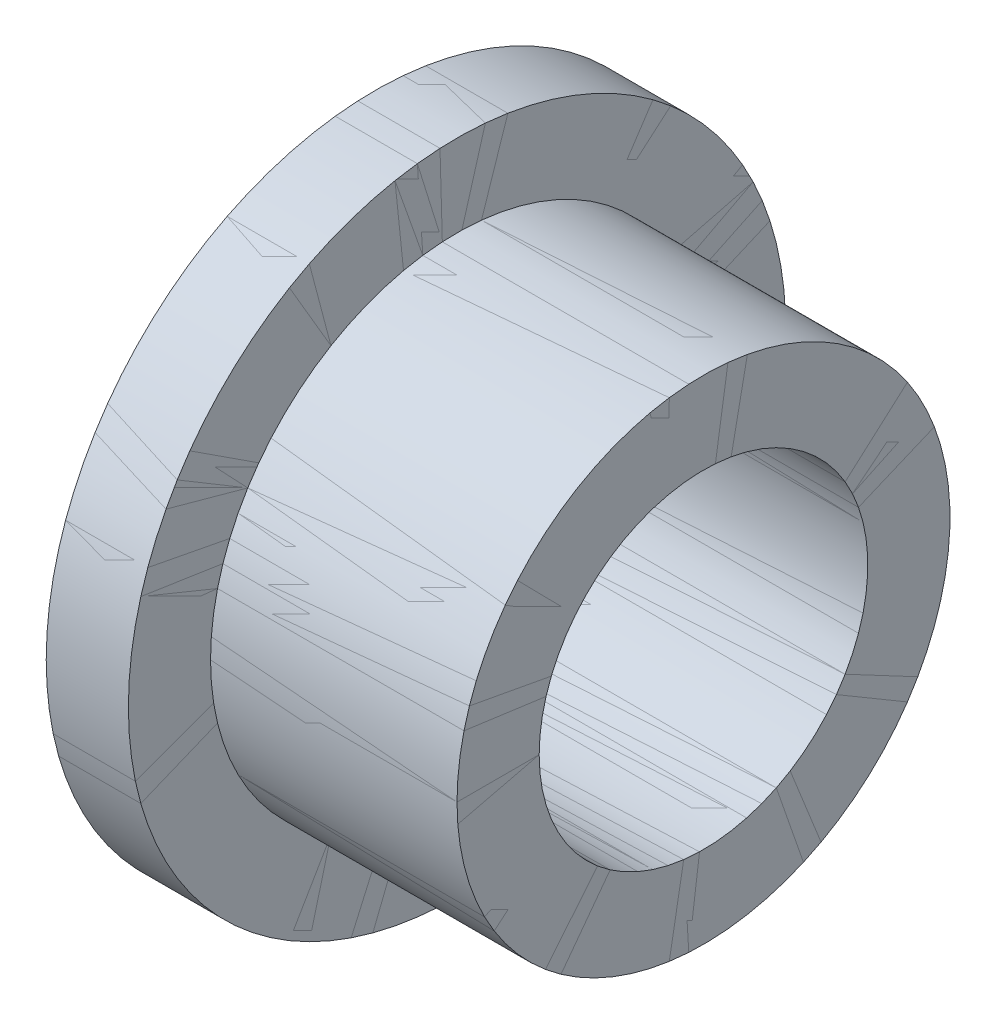
ISO-10303-21;
HEADER;
FILE_DESCRIPTION(('STEP AP214'),'2;1');
FILE_NAME('part.step','',(''),(''),'','','');
FILE_SCHEMA(('AUTOMOTIVE_DESIGN { 1 0 10303 214 1 1 1 1 }'));
ENDSEC;
DATA;
#1=APPLICATION_CONTEXT('core data for automotive mechanical design processes');
#2=APPLICATION_PROTOCOL_DEFINITION('international standard','automotive_design',2000,#1);
#3=PRODUCT_CONTEXT('',#1,'mechanical');
#4=PRODUCT('Part','Part','',(#3));
#5=PRODUCT_RELATED_PRODUCT_CATEGORY('part','',(#4));
#6=PRODUCT_DEFINITION_FORMATION('','',#4);
#7=PRODUCT_DEFINITION_CONTEXT('part definition',#1,'design');
#8=PRODUCT_DEFINITION('design','',#6,#7);
#9=PRODUCT_DEFINITION_SHAPE('','',#8);
#10=(LENGTH_UNIT() NAMED_UNIT(*) SI_UNIT(.MILLI.,.METRE.));
#11=(NAMED_UNIT(*) PLANE_ANGLE_UNIT() SI_UNIT($,.RADIAN.));
#12=(NAMED_UNIT(*) SI_UNIT($,.STERADIAN.) SOLID_ANGLE_UNIT());
#13=UNCERTAINTY_MEASURE_WITH_UNIT(LENGTH_MEASURE(1.E-05),#10,'distance_accuracy_value','');
#14=(GEOMETRIC_REPRESENTATION_CONTEXT(3) GLOBAL_UNCERTAINTY_ASSIGNED_CONTEXT((#13)) GLOBAL_UNIT_ASSIGNED_CONTEXT((#10,
#11,#12)) REPRESENTATION_CONTEXT('',''));
#15=CARTESIAN_POINT('',(0.,0.,0.));
#16=DIRECTION('',(0.,0.,1.));
#17=DIRECTION('',(1.,0.,0.));
#18=AXIS2_PLACEMENT_3D('',#15,#16,#17);
#19=CARTESIAN_POINT('',(0.,0.,0.));
#20=DIRECTION('',(-1.,0.,0.));
#21=DIRECTION('',(0.,0.,1.));
#22=AXIS2_PLACEMENT_3D('',#19,#20,#21);
#23=CYLINDRICAL_SURFACE('',#22,3.175);
#24=CARTESIAN_POINT('',(0.,0.,0.));
#25=DIRECTION('',(-1.,0.,0.));
#26=DIRECTION('',(0.,0.,1.));
#27=AXIS2_PLACEMENT_3D('',#24,#25,#26);
#28=CIRCLE('',#27,3.175);
#29=CARTESIAN_POINT('',(0.,0.,3.175));
#30=VERTEX_POINT('',#29);
#31=EDGE_CURVE('E60',#30,#30,#28,.T.);
#32=ORIENTED_EDGE('',*,*,#31,.T.);
#33=EDGE_LOOP('',(#32));
#34=FACE_BOUND('',#33,.T.);
#35=CARTESIAN_POINT('',(6.35,0.,0.));
#36=DIRECTION('',(-1.,0.,0.));
#37=DIRECTION('',(0.,0.,1.));
#38=AXIS2_PLACEMENT_3D('',#35,#36,#37);
#39=CIRCLE('',#38,3.175);
#40=CARTESIAN_POINT('',(6.35,0.,3.175));
#41=VERTEX_POINT('',#40);
#42=EDGE_CURVE('E11',#41,#41,#39,.T.);
#43=ORIENTED_EDGE('',*,*,#42,.F.);
#44=EDGE_LOOP('',(#43));
#45=FACE_BOUND('',#44,.T.);
#46=ADVANCED_FACE('F38',(#34,#45),#23,.F.);
#47=CARTESIAN_POINT('',(6.35,0.,3.175));
#48=DIRECTION('',(1.,0.,0.));
#49=DIRECTION('',(0.,0.,-1.));
#50=AXIS2_PLACEMENT_3D('',#47,#48,#49);
#51=PLANE('',#50);
#52=ORIENTED_EDGE('',*,*,#42,.T.);
#53=EDGE_LOOP('',(#52));
#54=FACE_BOUND('',#53,.T.);
#55=CARTESIAN_POINT('',(6.35,0.,0.));
#56=DIRECTION('',(-1.,0.,0.));
#57=DIRECTION('',(0.,0.,1.));
#58=AXIS2_PLACEMENT_3D('',#55,#56,#57);
#59=CIRCLE('',#58,4.7625);
#60=CARTESIAN_POINT('',(6.35,0.,4.7625));
#61=VERTEX_POINT('',#60);
#62=EDGE_CURVE('E44',#61,#61,#59,.T.);
#63=ORIENTED_EDGE('',*,*,#62,.F.);
#64=EDGE_LOOP('',(#63));
#65=FACE_BOUND('',#64,.T.);
#66=ADVANCED_FACE('F78',(#54,#65),#51,.T.);
#67=CARTESIAN_POINT('',(0.,0.,0.));
#68=DIRECTION('',(-1.,0.,0.));
#69=DIRECTION('',(0.,0.,1.));
#70=AXIS2_PLACEMENT_3D('',#67,#68,#69);
#71=CYLINDRICAL_SURFACE('',#70,4.7625);
#72=ORIENTED_EDGE('',*,*,#62,.T.);
#73=EDGE_LOOP('',(#72));
#74=FACE_BOUND('',#73,.T.);
#75=CARTESIAN_POINT('',(1.5875,0.,0.));
#76=DIRECTION('',(-1.,0.,0.));
#77=DIRECTION('',(0.,0.,1.));
#78=AXIS2_PLACEMENT_3D('',#75,#76,#77);
#79=CIRCLE('',#78,4.7625);
#80=CARTESIAN_POINT('',(1.5875,0.,4.7625));
#81=VERTEX_POINT('',#80);
#82=EDGE_CURVE('E48',#81,#81,#79,.T.);
#83=ORIENTED_EDGE('',*,*,#82,.F.);
#84=EDGE_LOOP('',(#83));
#85=FACE_BOUND('',#84,.T.);
#86=ADVANCED_FACE('F82',(#74,#85),#71,.T.);
#87=CARTESIAN_POINT('',(1.5875,0.,4.7625));
#88=DIRECTION('',(1.,0.,0.));
#89=DIRECTION('',(0.,0.,-1.));
#90=AXIS2_PLACEMENT_3D('',#87,#88,#89);
#91=PLANE('',#90);
#92=ORIENTED_EDGE('',*,*,#82,.T.);
#93=EDGE_LOOP('',(#92));
#94=FACE_BOUND('',#93,.T.);
#95=CARTESIAN_POINT('',(1.5875,0.,0.));
#96=DIRECTION('',(-1.,0.,0.));
#97=DIRECTION('',(0.,0.,1.));
#98=AXIS2_PLACEMENT_3D('',#95,#96,#97);
#99=CIRCLE('',#98,6.35);
#100=CARTESIAN_POINT('',(1.5875,0.,6.35));
#101=VERTEX_POINT('',#100);
#102=EDGE_CURVE('E52',#101,#101,#99,.T.);
#103=ORIENTED_EDGE('',*,*,#102,.F.);
#104=EDGE_LOOP('',(#103));
#105=FACE_BOUND('',#104,.T.);
#106=ADVANCED_FACE('F74',(#94,#105),#91,.T.);
#107=CARTESIAN_POINT('',(0.,0.,0.));
#108=DIRECTION('',(-1.,0.,0.));
#109=DIRECTION('',(0.,0.,1.));
#110=AXIS2_PLACEMENT_3D('',#107,#108,#109);
#111=CYLINDRICAL_SURFACE('',#110,6.35);
#112=ORIENTED_EDGE('',*,*,#102,.T.);
#113=EDGE_LOOP('',(#112));
#114=FACE_BOUND('',#113,.T.);
#115=CARTESIAN_POINT('',(0.,0.,0.));
#116=DIRECTION('',(-1.,0.,0.));
#117=DIRECTION('',(0.,0.,1.));
#118=AXIS2_PLACEMENT_3D('',#115,#116,#117);
#119=CIRCLE('',#118,6.35);
#120=CARTESIAN_POINT('',(0.,0.,6.35));
#121=VERTEX_POINT('',#120);
#122=EDGE_CURVE('E57',#121,#121,#119,.T.);
#123=ORIENTED_EDGE('',*,*,#122,.F.);
#124=EDGE_LOOP('',(#123));
#125=FACE_BOUND('',#124,.T.);
#126=ADVANCED_FACE('F68',(#114,#125),#111,.T.);
#127=CARTESIAN_POINT('',(0.,0.,6.35));
#128=DIRECTION('',(-1.,0.,0.));
#129=DIRECTION('',(0.,0.,1.));
#130=AXIS2_PLACEMENT_3D('',#127,#128,#129);
#131=PLANE('',#130);
#132=ORIENTED_EDGE('',*,*,#122,.T.);
#133=EDGE_LOOP('',(#132));
#134=FACE_BOUND('',#133,.T.);
#135=ORIENTED_EDGE('',*,*,#31,.F.);
#136=EDGE_LOOP('',(#135));
#137=FACE_BOUND('',#136,.T.);
#138=ADVANCED_FACE('F66',(#134,#137),#131,.T.);
#139=CLOSED_SHELL('',(#46,#66,#86,#106,#126,#138));
#140=MANIFOLD_SOLID_BREP('B2',#139);
#141=CARTESIAN_POINT('',(0.,0.,-6.35));
#142=DIRECTION('',(1.,0.,0.));
#143=DIRECTION('',(0.,0.,-1.));
#144=AXIS2_PLACEMENT_3D('',#141,#142,#143);
#145=PLANE('',#144);
#146=CARTESIAN_POINT('',(0.,0.,0.));
#147=DIRECTION('',(-1.,0.,0.));
#148=DIRECTION('',(0.,0.,1.));
#149=AXIS2_PLACEMENT_3D('',#146,#147,#148);
#150=CIRCLE('',#149,3.175);
#151=CARTESIAN_POINT('',(0.,0.,3.175));
#152=VERTEX_POINT('',#151);
#153=EDGE_CURVE('E37',#152,#152,#150,.T.);
#154=ORIENTED_EDGE('',*,*,#153,.F.);
#155=EDGE_LOOP('',(#154));
#156=FACE_BOUND('',#155,.T.);
#157=CARTESIAN_POINT('',(0.,0.,0.));
#158=DIRECTION('',(-1.,0.,0.));
#159=DIRECTION('',(0.,0.,1.));
#160=AXIS2_PLACEMENT_3D('',#157,#158,#159);
#161=CIRCLE('',#160,6.35);
#162=CARTESIAN_POINT('',(0.,0.,6.35));
#163=VERTEX_POINT('',#162);
#164=EDGE_CURVE('E151',#163,#163,#161,.T.);
#165=ORIENTED_EDGE('',*,*,#164,.T.);
#166=EDGE_LOOP('',(#165));
#167=FACE_BOUND('',#166,.T.);
#168=ADVANCED_FACE('F129',(#156,#167),#145,.F.);
#169=CARTESIAN_POINT('',(0.,0.,0.));
#170=DIRECTION('',(-1.,0.,0.));
#171=DIRECTION('',(0.,0.,1.));
#172=AXIS2_PLACEMENT_3D('',#169,#170,#171);
#173=CYLINDRICAL_SURFACE('',#172,3.175);
#174=CARTESIAN_POINT('',(6.35,0.,0.));
#175=DIRECTION('',(-1.,0.,0.));
#176=DIRECTION('',(0.,0.,1.));
#177=AXIS2_PLACEMENT_3D('',#174,#175,#176);
#178=CIRCLE('',#177,3.175);
#179=CARTESIAN_POINT('',(6.35,0.,3.175));
#180=VERTEX_POINT('',#179);
#181=EDGE_CURVE('E135',#180,#180,#178,.T.);
#182=ORIENTED_EDGE('',*,*,#181,.F.);
#183=EDGE_LOOP('',(#182));
#184=FACE_BOUND('',#183,.T.);
#185=ORIENTED_EDGE('',*,*,#153,.T.);
#186=EDGE_LOOP('',(#185));
#187=FACE_BOUND('',#186,.T.);
#188=ADVANCED_FACE('F176',(#184,#187),#173,.F.);
#189=CARTESIAN_POINT('',(6.35,0.,-3.175));
#190=DIRECTION('',(-1.,0.,0.));
#191=DIRECTION('',(0.,0.,1.));
#192=AXIS2_PLACEMENT_3D('',#189,#190,#191);
#193=PLANE('',#192);
#194=CARTESIAN_POINT('',(6.35,0.,0.));
#195=DIRECTION('',(-1.,0.,0.));
#196=DIRECTION('',(0.,0.,1.));
#197=AXIS2_PLACEMENT_3D('',#194,#195,#196);
#198=CIRCLE('',#197,4.7625);
#199=CARTESIAN_POINT('',(6.35,0.,4.7625));
#200=VERTEX_POINT('',#199);
#201=EDGE_CURVE('E139',#200,#200,#198,.T.);
#202=ORIENTED_EDGE('',*,*,#201,.F.);
#203=EDGE_LOOP('',(#202));
#204=FACE_BOUND('',#203,.T.);
#205=ORIENTED_EDGE('',*,*,#181,.T.);
#206=EDGE_LOOP('',(#205));
#207=FACE_BOUND('',#206,.T.);
#208=ADVANCED_FACE('F171',(#204,#207),#193,.F.);
#209=CARTESIAN_POINT('',(0.,0.,0.));
#210=DIRECTION('',(-1.,0.,0.));
#211=DIRECTION('',(0.,0.,1.));
#212=AXIS2_PLACEMENT_3D('',#209,#210,#211);
#213=CYLINDRICAL_SURFACE('',#212,4.7625);
#214=CARTESIAN_POINT('',(1.5875,0.,0.));
#215=DIRECTION('',(-1.,0.,0.));
#216=DIRECTION('',(0.,0.,1.));
#217=AXIS2_PLACEMENT_3D('',#214,#215,#216);
#218=CIRCLE('',#217,4.7625);
#219=CARTESIAN_POINT('',(1.5875,0.,4.7625));
#220=VERTEX_POINT('',#219);
#221=EDGE_CURVE('E143',#220,#220,#218,.T.);
#222=ORIENTED_EDGE('',*,*,#221,.F.);
#223=EDGE_LOOP('',(#222));
#224=FACE_BOUND('',#223,.T.);
#225=ORIENTED_EDGE('',*,*,#201,.T.);
#226=EDGE_LOOP('',(#225));
#227=FACE_BOUND('',#226,.T.);
#228=ADVANCED_FACE('F165',(#224,#227),#213,.T.);
#229=CARTESIAN_POINT('',(1.5875,0.,-4.7625));
#230=DIRECTION('',(-1.,0.,0.));
#231=DIRECTION('',(0.,0.,1.));
#232=AXIS2_PLACEMENT_3D('',#229,#230,#231);
#233=PLANE('',#232);
#234=CARTESIAN_POINT('',(1.5875,0.,0.));
#235=DIRECTION('',(-1.,0.,0.));
#236=DIRECTION('',(0.,0.,1.));
#237=AXIS2_PLACEMENT_3D('',#234,#235,#236);
#238=CIRCLE('',#237,6.35);
#239=CARTESIAN_POINT('',(1.5875,0.,6.35));
#240=VERTEX_POINT('',#239);
#241=EDGE_CURVE('E148',#240,#240,#238,.T.);
#242=ORIENTED_EDGE('',*,*,#241,.F.);
#243=EDGE_LOOP('',(#242));
#244=FACE_BOUND('',#243,.T.);
#245=ORIENTED_EDGE('',*,*,#221,.T.);
#246=EDGE_LOOP('',(#245));
#247=FACE_BOUND('',#246,.T.);
#248=ADVANCED_FACE('F159',(#244,#247),#233,.F.);
#249=CARTESIAN_POINT('',(0.,0.,0.));
#250=DIRECTION('',(-1.,0.,0.));
#251=DIRECTION('',(0.,0.,1.));
#252=AXIS2_PLACEMENT_3D('',#249,#250,#251);
#253=CYLINDRICAL_SURFACE('',#252,6.35);
#254=ORIENTED_EDGE('',*,*,#164,.F.);
#255=EDGE_LOOP('',(#254));
#256=FACE_BOUND('',#255,.T.);
#257=ORIENTED_EDGE('',*,*,#241,.T.);
#258=EDGE_LOOP('',(#257));
#259=FACE_BOUND('',#258,.T.);
#260=ADVANCED_FACE('F156',(#256,#259),#253,.T.);
#261=CLOSED_SHELL('',(#168,#188,#208,#228,#248,#260));
#262=MANIFOLD_SOLID_BREP('B6',#261);
#263=ADVANCED_BREP_SHAPE_REPRESENTATION('',(#18,#140,#262),#14);
#264=SHAPE_DEFINITION_REPRESENTATION(#9,#263);
ENDSEC;
END-ISO-10303-21;
